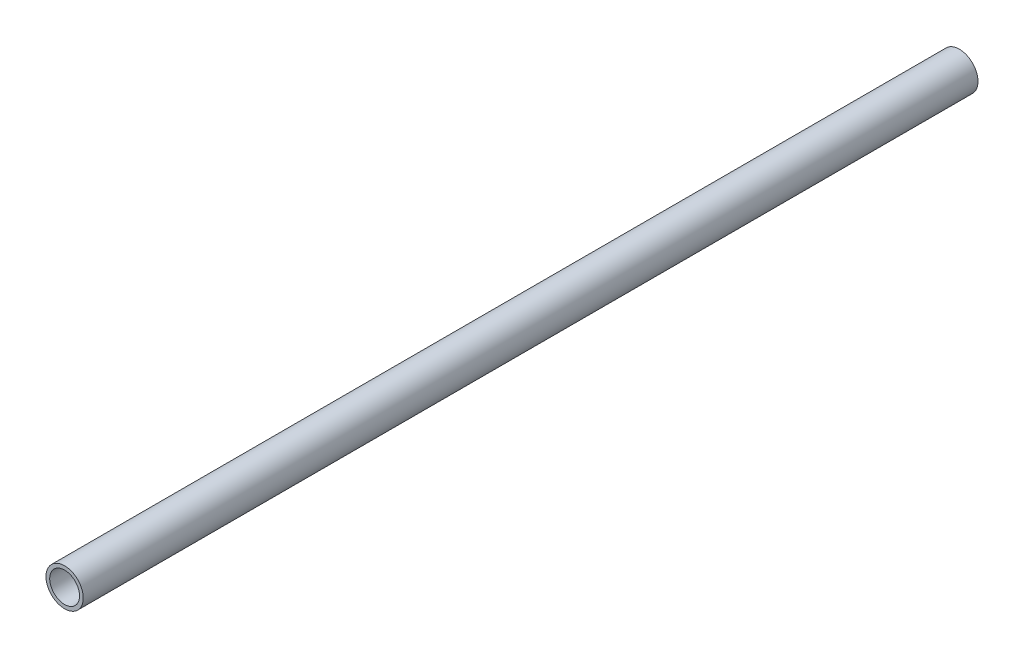
ISO-10303-21;
HEADER;
FILE_DESCRIPTION(('STEP AP214'),'2;1');
FILE_NAME('part.step','',(''),(''),'','','');
FILE_SCHEMA(('AUTOMOTIVE_DESIGN { 1 0 10303 214 1 1 1 1 }'));
ENDSEC;
DATA;
#1=APPLICATION_CONTEXT('core data for automotive mechanical design processes');
#2=APPLICATION_PROTOCOL_DEFINITION('international standard','automotive_design',2000,#1);
#3=PRODUCT_CONTEXT('',#1,'mechanical');
#4=PRODUCT('Part','Part','',(#3));
#5=PRODUCT_RELATED_PRODUCT_CATEGORY('part','',(#4));
#6=PRODUCT_DEFINITION_FORMATION('','',#4);
#7=PRODUCT_DEFINITION_CONTEXT('part definition',#1,'design');
#8=PRODUCT_DEFINITION('design','',#6,#7);
#9=PRODUCT_DEFINITION_SHAPE('','',#8);
#10=(LENGTH_UNIT() NAMED_UNIT(*) SI_UNIT(.MILLI.,.METRE.));
#11=(NAMED_UNIT(*) PLANE_ANGLE_UNIT() SI_UNIT($,.RADIAN.));
#12=(NAMED_UNIT(*) SI_UNIT($,.STERADIAN.) SOLID_ANGLE_UNIT());
#13=UNCERTAINTY_MEASURE_WITH_UNIT(LENGTH_MEASURE(1.E-05),#10,'distance_accuracy_value','');
#14=(GEOMETRIC_REPRESENTATION_CONTEXT(3) GLOBAL_UNCERTAINTY_ASSIGNED_CONTEXT((#13)) GLOBAL_UNIT_ASSIGNED_CONTEXT((#10,
#11,#12)) REPRESENTATION_CONTEXT('',''));
#15=CARTESIAN_POINT('',(0.,0.,0.));
#16=DIRECTION('',(0.,0.,1.));
#17=DIRECTION('',(1.,0.,0.));
#18=AXIS2_PLACEMENT_3D('',#15,#16,#17);
#19=CARTESIAN_POINT('',(0.,0.,609.6));
#20=DIRECTION('',(0.,0.,1.));
#21=DIRECTION('',(1.,0.,0.));
#22=AXIS2_PLACEMENT_3D('',#19,#20,#21);
#23=PLANE('',#22);
#24=CARTESIAN_POINT('',(0.,0.,609.6));
#25=DIRECTION('',(0.,0.,1.));
#26=DIRECTION('',(1.,0.,0.));
#27=AXIS2_PLACEMENT_3D('',#24,#25,#26);
#28=CIRCLE('',#27,12.7);
#29=CARTESIAN_POINT('',(12.7,0.,609.6));
#30=VERTEX_POINT('',#29);
#31=EDGE_CURVE('E10',#30,#30,#28,.T.);
#32=ORIENTED_EDGE('',*,*,#31,.T.);
#33=EDGE_LOOP('',(#32));
#34=FACE_BOUND('',#33,.T.);
#35=CARTESIAN_POINT('',(0.,0.,609.6));
#36=DIRECTION('',(0.,0.,1.));
#37=DIRECTION('',(1.,0.,0.));
#38=AXIS2_PLACEMENT_3D('',#35,#36,#37);
#39=CIRCLE('',#38,10.16);
#40=CARTESIAN_POINT('',(10.16,0.,609.6));
#41=VERTEX_POINT('',#40);
#42=EDGE_CURVE('E41',#41,#41,#39,.T.);
#43=ORIENTED_EDGE('',*,*,#42,.F.);
#44=EDGE_LOOP('',(#43));
#45=FACE_BOUND('',#44,.T.);
#46=ADVANCED_FACE('F30',(#34,#45),#23,.T.);
#47=CARTESIAN_POINT('',(0.,0.,0.));
#48=DIRECTION('',(0.,0.,1.));
#49=DIRECTION('',(1.,0.,0.));
#50=AXIS2_PLACEMENT_3D('',#47,#48,#49);
#51=PLANE('',#50);
#52=CARTESIAN_POINT('',(0.,0.,0.));
#53=DIRECTION('',(0.,0.,1.));
#54=DIRECTION('',(1.,0.,0.));
#55=AXIS2_PLACEMENT_3D('',#52,#53,#54);
#56=CIRCLE('',#55,12.7);
#57=CARTESIAN_POINT('',(12.7,0.,0.));
#58=VERTEX_POINT('',#57);
#59=EDGE_CURVE('E34',#58,#58,#56,.T.);
#60=ORIENTED_EDGE('',*,*,#59,.F.);
#61=EDGE_LOOP('',(#60));
#62=FACE_BOUND('',#61,.T.);
#63=CARTESIAN_POINT('',(0.,0.,0.));
#64=DIRECTION('',(0.,0.,1.));
#65=DIRECTION('',(1.,0.,0.));
#66=AXIS2_PLACEMENT_3D('',#63,#64,#65);
#67=CIRCLE('',#66,10.16);
#68=CARTESIAN_POINT('',(10.16,0.,0.));
#69=VERTEX_POINT('',#68);
#70=EDGE_CURVE('E43',#69,#69,#67,.T.);
#71=ORIENTED_EDGE('',*,*,#70,.T.);
#72=EDGE_LOOP('',(#71));
#73=FACE_BOUND('',#72,.T.);
#74=ADVANCED_FACE('F53',(#62,#73),#51,.F.);
#75=CARTESIAN_POINT('',(0.,0.,609.6));
#76=DIRECTION('',(0.,0.,-1.));
#77=DIRECTION('',(-1.,0.,0.));
#78=AXIS2_PLACEMENT_3D('',#75,#76,#77);
#79=CYLINDRICAL_SURFACE('',#78,12.7);
#80=ORIENTED_EDGE('',*,*,#31,.F.);
#81=EDGE_LOOP('',(#80));
#82=FACE_BOUND('',#81,.T.);
#83=ORIENTED_EDGE('',*,*,#59,.T.);
#84=EDGE_LOOP('',(#83));
#85=FACE_BOUND('',#84,.T.);
#86=ADVANCED_FACE('F32',(#82,#85),#79,.T.);
#87=CARTESIAN_POINT('',(0.,0.,609.6));
#88=DIRECTION('',(0.,0.,-1.));
#89=DIRECTION('',(-1.,0.,0.));
#90=AXIS2_PLACEMENT_3D('',#87,#88,#89);
#91=CYLINDRICAL_SURFACE('',#90,10.16);
#92=ORIENTED_EDGE('',*,*,#42,.T.);
#93=EDGE_LOOP('',(#92));
#94=FACE_BOUND('',#93,.T.);
#95=ORIENTED_EDGE('',*,*,#70,.F.);
#96=EDGE_LOOP('',(#95));
#97=FACE_BOUND('',#96,.T.);
#98=ADVANCED_FACE('F49',(#94,#97),#91,.F.);
#99=CLOSED_SHELL('',(#46,#74,#86,#98));
#100=MANIFOLD_SOLID_BREP('B2',#99);
#101=ADVANCED_BREP_SHAPE_REPRESENTATION('',(#18,#100),#14);
#102=SHAPE_DEFINITION_REPRESENTATION(#9,#101);
ENDSEC;
END-ISO-10303-21;
